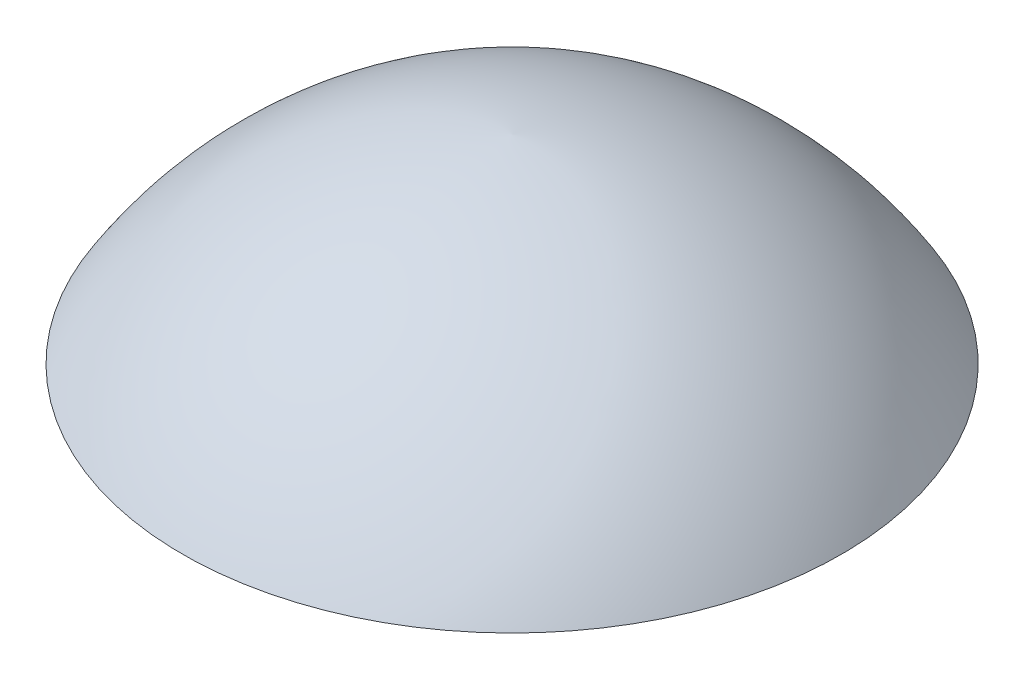
ISO-10303-21;
HEADER;
FILE_DESCRIPTION(('STEP AP214'),'2;1');
FILE_NAME('part.step','',(''),(''),'','','');
FILE_SCHEMA(('AUTOMOTIVE_DESIGN { 1 0 10303 214 1 1 1 1 }'));
ENDSEC;
DATA;
#1=APPLICATION_CONTEXT('core data for automotive mechanical design processes');
#2=APPLICATION_PROTOCOL_DEFINITION('international standard','automotive_design',2000,#1);
#3=PRODUCT_CONTEXT('',#1,'mechanical');
#4=PRODUCT('Part','Part','',(#3));
#5=PRODUCT_RELATED_PRODUCT_CATEGORY('part','',(#4));
#6=PRODUCT_DEFINITION_FORMATION('','',#4);
#7=PRODUCT_DEFINITION_CONTEXT('part definition',#1,'design');
#8=PRODUCT_DEFINITION('design','',#6,#7);
#9=PRODUCT_DEFINITION_SHAPE('','',#8);
#10=(LENGTH_UNIT() NAMED_UNIT(*) SI_UNIT(.MILLI.,.METRE.));
#11=(NAMED_UNIT(*) PLANE_ANGLE_UNIT() SI_UNIT($,.RADIAN.));
#12=(NAMED_UNIT(*) SI_UNIT($,.STERADIAN.) SOLID_ANGLE_UNIT());
#13=UNCERTAINTY_MEASURE_WITH_UNIT(LENGTH_MEASURE(1.E-05),#10,'distance_accuracy_value','');
#14=(GEOMETRIC_REPRESENTATION_CONTEXT(3) GLOBAL_UNCERTAINTY_ASSIGNED_CONTEXT((#13)) GLOBAL_UNIT_ASSIGNED_CONTEXT((#10,
#11,#12)) REPRESENTATION_CONTEXT('',''));
#15=CARTESIAN_POINT('',(0.,0.,0.));
#16=DIRECTION('',(0.,0.,1.));
#17=DIRECTION('',(1.,0.,0.));
#18=AXIS2_PLACEMENT_3D('',#15,#16,#17);
#19=CARTESIAN_POINT('',(0.,0.,0.));
#20=DIRECTION('',(0.,1.,0.));
#21=DIRECTION('',(0.,0.,1.));
#22=AXIS2_PLACEMENT_3D('',#19,#20,#21);
#23=PLANE('',#22);
#24=CARTESIAN_POINT('',(0.,0.,0.));
#25=DIRECTION('',(0.,-1.,0.));
#26=DIRECTION('',(0.,0.,-1.));
#27=AXIS2_PLACEMENT_3D('',#24,#25,#26);
#28=CIRCLE('',#27,16.5);
#29=CARTESIAN_POINT('',(0.,0.,-16.5));
#30=VERTEX_POINT('',#29);
#31=EDGE_CURVE('E11',#30,#30,#28,.T.);
#32=ORIENTED_EDGE('',*,*,#31,.T.);
#33=EDGE_LOOP('',(#32));
#34=FACE_BOUND('',#33,.T.);
#35=ADVANCED_FACE('F37',(#34),#23,.F.);
#36=CARTESIAN_POINT('',(0.,-10.9230730879463,1.33612095729698));
#37=DIRECTION('',(-1.,0.,0.));
#38=DIRECTION('',(0.,0.,-1.));
#39=AXIS2_PLACEMENT_3D('',#36,#37,#38);
#40=CIRCLE('',#39,20.9150839464714);
#41=TRIMMED_CURVE('',#40,(PARAMETER_VALUE(-1.50686966837452)),
(PARAMETER_VALUE(1.50686966837452)),.T.,.PARAMETER.);
#42=CARTESIAN_POINT('',(0.,-10.9230730879463,0.));
#43=DIRECTION('',(0.,-1.,0.));
#44=AXIS1_PLACEMENT('',#42,#43);
#45=SURFACE_OF_REVOLUTION('',#41,#44);
#46=ORIENTED_EDGE('',*,*,#31,.F.);
#47=EDGE_LOOP('',(#46));
#48=FACE_BOUND('',#47,.T.);
#49=CARTESIAN_POINT('',(0.,9.94928943466758,0.));
#50=VERTEX_POINT('',#49);
#51=VERTEX_LOOP('',#50);
#52=FACE_BOUND('',#51,.T.);
#53=ADVANCED_FACE('F44',(#48,#52),#45,.T.);
#54=CLOSED_SHELL('',(#35,#53));
#55=MANIFOLD_SOLID_BREP('B2',#54);
#56=ADVANCED_BREP_SHAPE_REPRESENTATION('',(#18,#55),#14);
#57=SHAPE_DEFINITION_REPRESENTATION(#9,#56);
ENDSEC;
END-ISO-10303-21;
